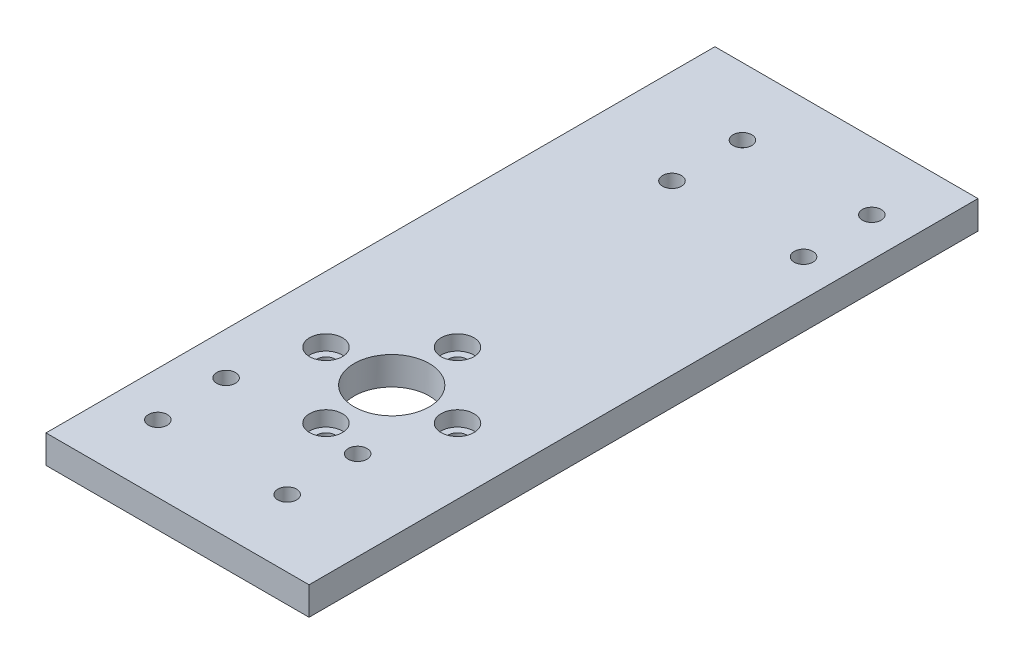
ISO-10303-21;
HEADER;
FILE_DESCRIPTION(('STEP AP214'),'2;1');
FILE_NAME('part.step','',(''),(''),'','','');
FILE_SCHEMA(('AUTOMOTIVE_DESIGN { 1 0 10303 214 1 1 1 1 }'));
ENDSEC;
DATA;
#1=APPLICATION_CONTEXT('core data for automotive mechanical design processes');
#2=APPLICATION_PROTOCOL_DEFINITION('international standard','automotive_design',2000,#1);
#3=PRODUCT_CONTEXT('',#1,'mechanical');
#4=PRODUCT('Part','Part','',(#3));
#5=PRODUCT_RELATED_PRODUCT_CATEGORY('part','',(#4));
#6=PRODUCT_DEFINITION_FORMATION('','',#4);
#7=PRODUCT_DEFINITION_CONTEXT('part definition',#1,'design');
#8=PRODUCT_DEFINITION('design','',#6,#7);
#9=PRODUCT_DEFINITION_SHAPE('','',#8);
#10=(LENGTH_UNIT() NAMED_UNIT(*) SI_UNIT(.MILLI.,.METRE.));
#11=(NAMED_UNIT(*) PLANE_ANGLE_UNIT() SI_UNIT($,.RADIAN.));
#12=(NAMED_UNIT(*) SI_UNIT($,.STERADIAN.) SOLID_ANGLE_UNIT());
#13=UNCERTAINTY_MEASURE_WITH_UNIT(LENGTH_MEASURE(1.E-05),#10,'distance_accuracy_value','');
#14=(GEOMETRIC_REPRESENTATION_CONTEXT(3) GLOBAL_UNCERTAINTY_ASSIGNED_CONTEXT((#13)) GLOBAL_UNIT_ASSIGNED_CONTEXT((#10,
#11,#12)) REPRESENTATION_CONTEXT('',''));
#15=CARTESIAN_POINT('',(0.,0.,0.));
#16=DIRECTION('',(0.,0.,1.));
#17=DIRECTION('',(1.,0.,0.));
#18=AXIS2_PLACEMENT_3D('',#15,#16,#17);
#19=CARTESIAN_POINT('',(-3.91877513505073,-7.,-28.4481628818932));
#20=DIRECTION('',(0.,1.,0.));
#21=DIRECTION('',(0.,0.,1.));
#22=AXIS2_PLACEMENT_3D('',#19,#20,#21);
#23=CYLINDRICAL_SURFACE('',#22,1.00000000000001);
#24=CARTESIAN_POINT('',(-3.91877513505073,3.,-28.4481628818932));
#25=DIRECTION('',(0.,1.,0.));
#26=DIRECTION('',(0.,0.,1.));
#27=AXIS2_PLACEMENT_3D('',#24,#25,#26);
#28=CIRCLE('',#27,1.00000000000001);
#29=CARTESIAN_POINT('',(-3.91877513505073,3.,-27.4481628818932));
#30=VERTEX_POINT('',#29);
#31=EDGE_CURVE('E243',#30,#30,#28,.T.);
#32=ORIENTED_EDGE('',*,*,#31,.T.);
#33=EDGE_LOOP('',(#32));
#34=FACE_BOUND('',#33,.T.);
#35=CARTESIAN_POINT('',(-3.91877513505073,1.6,-28.4481628818932));
#36=DIRECTION('',(0.,-1.,0.));
#37=DIRECTION('',(0.,0.,-1.));
#38=AXIS2_PLACEMENT_3D('',#35,#36,#37);
#39=CIRCLE('',#38,1.00000000000001);
#40=CARTESIAN_POINT('',(-3.91877513505073,1.6,-29.4481628818932));
#41=VERTEX_POINT('',#40);
#42=EDGE_CURVE('E42',#41,#41,#39,.F.);
#43=ORIENTED_EDGE('',*,*,#42,.F.);
#44=EDGE_LOOP('',(#43));
#45=FACE_BOUND('',#44,.T.);
#46=ADVANCED_FACE('F38',(#34,#45),#23,.F.);
#47=CARTESIAN_POINT('',(4.51877513505392,-7.,20.9481628818913));
#48=DIRECTION('',(0.,1.,0.));
#49=DIRECTION('',(0.,0.,1.));
#50=AXIS2_PLACEMENT_3D('',#47,#48,#49);
#51=CYLINDRICAL_SURFACE('',#50,1.00000000000002);
#52=CARTESIAN_POINT('',(4.51877513505392,3.,20.9481628818913));
#53=DIRECTION('',(0.,1.,0.));
#54=DIRECTION('',(0.,0.,1.));
#55=AXIS2_PLACEMENT_3D('',#52,#53,#54);
#56=CIRCLE('',#55,1.00000000000002);
#57=CARTESIAN_POINT('',(4.51877513505392,3.,21.9481628818913));
#58=VERTEX_POINT('',#57);
#59=EDGE_CURVE('E246',#58,#58,#56,.T.);
#60=ORIENTED_EDGE('',*,*,#59,.T.);
#61=EDGE_LOOP('',(#60));
#62=FACE_BOUND('',#61,.T.);
#63=CARTESIAN_POINT('',(4.51877513505392,1.6,20.9481628818913));
#64=DIRECTION('',(0.,-1.,0.));
#65=DIRECTION('',(0.,0.,-1.));
#66=AXIS2_PLACEMENT_3D('',#63,#64,#65);
#67=CIRCLE('',#66,1.00000000000002);
#68=CARTESIAN_POINT('',(4.51877513505392,1.6,19.9481628818913));
#69=VERTEX_POINT('',#68);
#70=EDGE_CURVE('E178',#69,#69,#67,.F.);
#71=ORIENTED_EDGE('',*,*,#70,.F.);
#72=EDGE_LOOP('',(#71));
#73=FACE_BOUND('',#72,.T.);
#74=ADVANCED_FACE('F279',(#62,#73),#51,.F.);
#75=CARTESIAN_POINT('',(4.51877513505393,-7.,28.4481628818913));
#76=DIRECTION('',(0.,1.,0.));
#77=DIRECTION('',(0.,0.,1.));
#78=AXIS2_PLACEMENT_3D('',#75,#76,#77);
#79=CYLINDRICAL_SURFACE('',#78,1.00000000000002);
#80=CARTESIAN_POINT('',(4.51877513505393,3.,28.4481628818913));
#81=DIRECTION('',(0.,1.,0.));
#82=DIRECTION('',(0.,0.,1.));
#83=AXIS2_PLACEMENT_3D('',#80,#81,#82);
#84=CIRCLE('',#83,1.00000000000002);
#85=CARTESIAN_POINT('',(4.51877513505393,3.,29.4481628818913));
#86=VERTEX_POINT('',#85);
#87=EDGE_CURVE('E249',#86,#86,#84,.T.);
#88=ORIENTED_EDGE('',*,*,#87,.T.);
#89=EDGE_LOOP('',(#88));
#90=FACE_BOUND('',#89,.T.);
#91=CARTESIAN_POINT('',(4.51877513505393,1.6,28.4481628818913));
#92=DIRECTION('',(0.,-1.,0.));
#93=DIRECTION('',(0.,0.,-1.));
#94=AXIS2_PLACEMENT_3D('',#91,#92,#93);
#95=CIRCLE('',#94,1.00000000000002);
#96=CARTESIAN_POINT('',(4.51877513505393,1.6,27.4481628818913));
#97=VERTEX_POINT('',#96);
#98=EDGE_CURVE('E174',#97,#97,#95,.F.);
#99=ORIENTED_EDGE('',*,*,#98,.F.);
#100=EDGE_LOOP('',(#99));
#101=FACE_BOUND('',#100,.T.);
#102=ADVANCED_FACE('F285',(#90,#101),#79,.F.);
#103=CARTESIAN_POINT('',(-9.48122486494609,-7.,20.9481628818913));
#104=DIRECTION('',(0.,1.,0.));
#105=DIRECTION('',(0.,0.,1.));
#106=AXIS2_PLACEMENT_3D('',#103,#104,#105);
#107=CYLINDRICAL_SURFACE('',#106,1.00000000000001);
#108=CARTESIAN_POINT('',(-9.48122486494609,3.,20.9481628818913));
#109=DIRECTION('',(0.,1.,0.));
#110=DIRECTION('',(0.,0.,1.));
#111=AXIS2_PLACEMENT_3D('',#108,#109,#110);
#112=CIRCLE('',#111,1.00000000000001);
#113=CARTESIAN_POINT('',(-9.48122486494609,3.,21.9481628818913));
#114=VERTEX_POINT('',#113);
#115=EDGE_CURVE('E255',#114,#114,#112,.T.);
#116=ORIENTED_EDGE('',*,*,#115,.T.);
#117=EDGE_LOOP('',(#116));
#118=FACE_BOUND('',#117,.T.);
#119=CARTESIAN_POINT('',(-9.48122486494609,1.6,20.9481628818913));
#120=DIRECTION('',(0.,-1.,0.));
#121=DIRECTION('',(0.,0.,-1.));
#122=AXIS2_PLACEMENT_3D('',#119,#120,#121);
#123=CIRCLE('',#122,1.00000000000001);
#124=CARTESIAN_POINT('',(-9.48122486494609,1.6,19.9481628818913));
#125=VERTEX_POINT('',#124);
#126=EDGE_CURVE('E169',#125,#125,#123,.F.);
#127=ORIENTED_EDGE('',*,*,#126,.F.);
#128=EDGE_LOOP('',(#127));
#129=FACE_BOUND('',#128,.T.);
#130=ADVANCED_FACE('F295',(#118,#129),#107,.F.);
#131=CARTESIAN_POINT('',(-9.24883244467996,-7.,28.4481628818913));
#132=DIRECTION('',(0.,1.,0.));
#133=DIRECTION('',(0.,0.,1.));
#134=AXIS2_PLACEMENT_3D('',#131,#132,#133);
#135=CYLINDRICAL_SURFACE('',#134,1.00000000000001);
#136=CARTESIAN_POINT('',(-9.24883244467996,3.,28.4481628818913));
#137=DIRECTION('',(0.,1.,0.));
#138=DIRECTION('',(0.,0.,1.));
#139=AXIS2_PLACEMENT_3D('',#136,#137,#138);
#140=CIRCLE('',#139,1.00000000000001);
#141=CARTESIAN_POINT('',(-9.24883244467996,3.,29.4481628818913));
#142=VERTEX_POINT('',#141);
#143=EDGE_CURVE('E252',#142,#142,#140,.T.);
#144=ORIENTED_EDGE('',*,*,#143,.T.);
#145=EDGE_LOOP('',(#144));
#146=FACE_BOUND('',#145,.T.);
#147=CARTESIAN_POINT('',(-9.24883244467996,1.6,28.4481628818913));
#148=DIRECTION('',(0.,-1.,0.));
#149=DIRECTION('',(0.,0.,-1.));
#150=AXIS2_PLACEMENT_3D('',#147,#148,#149);
#151=CIRCLE('',#150,1.00000000000001);
#152=CARTESIAN_POINT('',(-9.24883244467996,1.6,27.4481628818913));
#153=VERTEX_POINT('',#152);
#154=EDGE_CURVE('E164',#153,#153,#151,.F.);
#155=ORIENTED_EDGE('',*,*,#154,.F.);
#156=EDGE_LOOP('',(#155));
#157=FACE_BOUND('',#156,.T.);
#158=ADVANCED_FACE('F297',(#146,#157),#135,.F.);
#159=CARTESIAN_POINT('',(10.0812248649493,-7.,-20.9481628818932));
#160=DIRECTION('',(0.,1.,0.));
#161=DIRECTION('',(0.,0.,1.));
#162=AXIS2_PLACEMENT_3D('',#159,#160,#161);
#163=CYLINDRICAL_SURFACE('',#162,1.);
#164=CARTESIAN_POINT('',(10.0812248649493,3.,-20.9481628818932));
#165=DIRECTION('',(0.,1.,0.));
#166=DIRECTION('',(0.,0.,1.));
#167=AXIS2_PLACEMENT_3D('',#164,#165,#166);
#168=CIRCLE('',#167,1.);
#169=CARTESIAN_POINT('',(10.0812248649493,3.,-19.9481628818932));
#170=VERTEX_POINT('',#169);
#171=EDGE_CURVE('E237',#170,#170,#168,.T.);
#172=ORIENTED_EDGE('',*,*,#171,.T.);
#173=EDGE_LOOP('',(#172));
#174=FACE_BOUND('',#173,.T.);
#175=CARTESIAN_POINT('',(10.0812248649493,1.6,-20.9481628818932));
#176=DIRECTION('',(0.,-1.,0.));
#177=DIRECTION('',(0.,0.,-1.));
#178=AXIS2_PLACEMENT_3D('',#175,#176,#177);
#179=CIRCLE('',#178,1.);
#180=CARTESIAN_POINT('',(10.0812248649493,1.6,-21.9481628818932));
#181=VERTEX_POINT('',#180);
#182=EDGE_CURVE('E159',#181,#181,#179,.F.);
#183=ORIENTED_EDGE('',*,*,#182,.F.);
#184=EDGE_LOOP('',(#183));
#185=FACE_BOUND('',#184,.T.);
#186=ADVANCED_FACE('F300',(#174,#185),#163,.F.);
#187=CARTESIAN_POINT('',(9.84883244468316,-7.,-28.4481628818932));
#188=DIRECTION('',(0.,1.,0.));
#189=DIRECTION('',(0.,0.,1.));
#190=AXIS2_PLACEMENT_3D('',#187,#188,#189);
#191=CYLINDRICAL_SURFACE('',#190,1.00000000000001);
#192=CARTESIAN_POINT('',(9.84883244468316,3.,-28.4481628818932));
#193=DIRECTION('',(0.,1.,0.));
#194=DIRECTION('',(0.,0.,1.));
#195=AXIS2_PLACEMENT_3D('',#192,#193,#194);
#196=CIRCLE('',#195,1.00000000000001);
#197=CARTESIAN_POINT('',(9.84883244468316,3.,-27.4481628818932));
#198=VERTEX_POINT('',#197);
#199=EDGE_CURVE('E240',#198,#198,#196,.T.);
#200=ORIENTED_EDGE('',*,*,#199,.T.);
#201=EDGE_LOOP('',(#200));
#202=FACE_BOUND('',#201,.T.);
#203=CARTESIAN_POINT('',(9.84883244468316,1.6,-28.4481628818932));
#204=DIRECTION('',(0.,-1.,0.));
#205=DIRECTION('',(0.,0.,-1.));
#206=AXIS2_PLACEMENT_3D('',#203,#204,#205);
#207=CIRCLE('',#206,1.00000000000001);
#208=CARTESIAN_POINT('',(9.84883244468316,1.6,-29.4481628818932));
#209=VERTEX_POINT('',#208);
#210=EDGE_CURVE('E154',#209,#209,#207,.F.);
#211=ORIENTED_EDGE('',*,*,#210,.F.);
#212=EDGE_LOOP('',(#211));
#213=FACE_BOUND('',#212,.T.);
#214=ADVANCED_FACE('F290',(#202,#213),#191,.F.);
#215=CARTESIAN_POINT('',(-3.91877513505072,-7.,-20.9481628818932));
#216=DIRECTION('',(0.,1.,0.));
#217=DIRECTION('',(0.,0.,1.));
#218=AXIS2_PLACEMENT_3D('',#215,#216,#217);
#219=CYLINDRICAL_SURFACE('',#218,1.00000000000001);
#220=CARTESIAN_POINT('',(-3.91877513505072,3.,-20.9481628818932));
#221=DIRECTION('',(0.,1.,0.));
#222=DIRECTION('',(0.,0.,1.));
#223=AXIS2_PLACEMENT_3D('',#220,#221,#222);
#224=CIRCLE('',#223,1.00000000000001);
#225=CARTESIAN_POINT('',(-3.91877513505072,3.,-19.9481628818932));
#226=VERTEX_POINT('',#225);
#227=EDGE_CURVE('E132',#226,#226,#224,.T.);
#228=ORIENTED_EDGE('',*,*,#227,.T.);
#229=EDGE_LOOP('',(#228));
#230=FACE_BOUND('',#229,.T.);
#231=CARTESIAN_POINT('',(-3.91877513505072,1.6,-20.9481628818932));
#232=DIRECTION('',(0.,-1.,0.));
#233=DIRECTION('',(0.,0.,-1.));
#234=AXIS2_PLACEMENT_3D('',#231,#232,#233);
#235=CIRCLE('',#234,1.00000000000001);
#236=CARTESIAN_POINT('',(-3.91877513505072,1.6,-21.9481628818932));
#237=VERTEX_POINT('',#236);
#238=EDGE_CURVE('E149',#237,#237,#235,.F.);
#239=ORIENTED_EDGE('',*,*,#238,.F.);
#240=EDGE_LOOP('',(#239));
#241=FACE_BOUND('',#240,.T.);
#242=ADVANCED_FACE('F320',(#230,#241),#219,.F.);
#243=CARTESIAN_POINT('',(7.0000000000001,-7.,12.7999999999978));
#244=DIRECTION('',(0.,1.,0.));
#245=DIRECTION('',(0.,0.,1.));
#246=AXIS2_PLACEMENT_3D('',#243,#244,#245);
#247=CYLINDRICAL_SURFACE('',#246,1.);
#248=CARTESIAN_POINT('',(7.0000000000001,0.,12.7999999999978));
#249=DIRECTION('',(0.,-1.,0.));
#250=DIRECTION('',(0.,0.,-1.));
#251=AXIS2_PLACEMENT_3D('',#248,#249,#250);
#252=CIRCLE('',#251,1.);
#253=CARTESIAN_POINT('',(7.0000000000001,0.,11.7999999999978));
#254=VERTEX_POINT('',#253);
#255=EDGE_CURVE('E116',#254,#254,#252,.T.);
#256=ORIENTED_EDGE('',*,*,#255,.T.);
#257=EDGE_LOOP('',(#256));
#258=FACE_BOUND('',#257,.T.);
#259=CARTESIAN_POINT('',(7.0000000000001,1.4,12.7999999999978));
#260=DIRECTION('',(0.,1.,0.));
#261=DIRECTION('',(0.,0.,1.));
#262=AXIS2_PLACEMENT_3D('',#259,#260,#261);
#263=CIRCLE('',#262,1.);
#264=CARTESIAN_POINT('',(7.0000000000001,1.4,13.7999999999978));
#265=VERTEX_POINT('',#264);
#266=EDGE_CURVE('E144',#265,#265,#263,.F.);
#267=ORIENTED_EDGE('',*,*,#266,.F.);
#268=EDGE_LOOP('',(#267));
#269=FACE_BOUND('',#268,.T.);
#270=ADVANCED_FACE('F313',(#258,#269),#247,.F.);
#271=CARTESIAN_POINT('',(-6.9999999999999,-7.,12.7999999999979));
#272=DIRECTION('',(0.,1.,0.));
#273=DIRECTION('',(0.,0.,1.));
#274=AXIS2_PLACEMENT_3D('',#271,#272,#273);
#275=CYLINDRICAL_SURFACE('',#274,1.);
#276=CARTESIAN_POINT('',(-6.9999999999999,0.,12.7999999999979));
#277=DIRECTION('',(0.,-1.,0.));
#278=DIRECTION('',(0.,0.,-1.));
#279=AXIS2_PLACEMENT_3D('',#276,#277,#278);
#280=CIRCLE('',#279,1.);
#281=CARTESIAN_POINT('',(-6.9999999999999,0.,11.7999999999979));
#282=VERTEX_POINT('',#281);
#283=EDGE_CURVE('E122',#282,#282,#280,.T.);
#284=ORIENTED_EDGE('',*,*,#283,.T.);
#285=EDGE_LOOP('',(#284));
#286=FACE_BOUND('',#285,.T.);
#287=CARTESIAN_POINT('',(-6.9999999999999,1.4,12.7999999999979));
#288=DIRECTION('',(0.,1.,0.));
#289=DIRECTION('',(0.,0.,1.));
#290=AXIS2_PLACEMENT_3D('',#287,#288,#289);
#291=CIRCLE('',#290,1.);
#292=CARTESIAN_POINT('',(-6.9999999999999,1.4,13.7999999999979));
#293=VERTEX_POINT('',#292);
#294=EDGE_CURVE('E139',#293,#293,#291,.F.);
#295=ORIENTED_EDGE('',*,*,#294,.F.);
#296=EDGE_LOOP('',(#295));
#297=FACE_BOUND('',#296,.T.);
#298=ADVANCED_FACE('F309',(#286,#297),#275,.F.);
#299=CARTESIAN_POINT('',(0.,-7.,5.79999999999792));
#300=DIRECTION('',(0.,1.,0.));
#301=DIRECTION('',(0.,0.,1.));
#302=AXIS2_PLACEMENT_3D('',#299,#300,#301);
#303=CYLINDRICAL_SURFACE('',#302,1.);
#304=CARTESIAN_POINT('',(0.,0.,5.79999999999792));
#305=DIRECTION('',(0.,-1.,0.));
#306=DIRECTION('',(0.,0.,-1.));
#307=AXIS2_PLACEMENT_3D('',#304,#305,#306);
#308=CIRCLE('',#307,1.);
#309=CARTESIAN_POINT('',(0.,0.,4.79999999999792));
#310=VERTEX_POINT('',#309);
#311=EDGE_CURVE('E108',#310,#310,#308,.T.);
#312=ORIENTED_EDGE('',*,*,#311,.T.);
#313=EDGE_LOOP('',(#312));
#314=FACE_BOUND('',#313,.T.);
#315=CARTESIAN_POINT('',(0.,1.4,5.79999999999792));
#316=DIRECTION('',(0.,1.,0.));
#317=DIRECTION('',(0.,0.,1.));
#318=AXIS2_PLACEMENT_3D('',#315,#316,#317);
#319=CIRCLE('',#318,1.);
#320=CARTESIAN_POINT('',(0.,1.4,6.79999999999792));
#321=VERTEX_POINT('',#320);
#322=EDGE_CURVE('E134',#321,#321,#319,.F.);
#323=ORIENTED_EDGE('',*,*,#322,.F.);
#324=EDGE_LOOP('',(#323));
#325=FACE_BOUND('',#324,.T.);
#326=ADVANCED_FACE('F312',(#314,#325),#303,.F.);
#327=CARTESIAN_POINT('',(1.45764745514838E-13,-7.,19.7999999999979));
#328=DIRECTION('',(0.,1.,0.));
#329=DIRECTION('',(0.,0.,1.));
#330=AXIS2_PLACEMENT_3D('',#327,#328,#329);
#331=CYLINDRICAL_SURFACE('',#330,1.);
#332=CARTESIAN_POINT('',(1.45764745514838E-13,0.,19.7999999999979));
#333=DIRECTION('',(0.,-1.,0.));
#334=DIRECTION('',(0.,0.,-1.));
#335=AXIS2_PLACEMENT_3D('',#332,#333,#334);
#336=CIRCLE('',#335,1.);
#337=CARTESIAN_POINT('',(1.45764745514838E-13,0.,18.7999999999979));
#338=VERTEX_POINT('',#337);
#339=EDGE_CURVE('E119',#338,#338,#336,.T.);
#340=ORIENTED_EDGE('',*,*,#339,.T.);
#341=EDGE_LOOP('',(#340));
#342=FACE_BOUND('',#341,.T.);
#343=CARTESIAN_POINT('',(1.45764745514838E-13,1.4,19.7999999999979));
#344=DIRECTION('',(0.,1.,0.));
#345=DIRECTION('',(0.,0.,1.));
#346=AXIS2_PLACEMENT_3D('',#343,#344,#345);
#347=CIRCLE('',#346,1.);
#348=CARTESIAN_POINT('',(1.45764745514838E-13,1.4,20.7999999999979));
#349=VERTEX_POINT('',#348);
#350=EDGE_CURVE('E129',#349,#349,#347,.F.);
#351=ORIENTED_EDGE('',*,*,#350,.F.);
#352=EDGE_LOOP('',(#351));
#353=FACE_BOUND('',#352,.T.);
#354=ADVANCED_FACE('F315',(#342,#353),#331,.F.);
#355=CARTESIAN_POINT('',(14.,3.,35.6));
#356=DIRECTION('',(-1.,0.,0.));
#357=DIRECTION('',(0.,0.,1.));
#358=AXIS2_PLACEMENT_3D('',#355,#356,#357);
#359=PLANE('',#358);
#360=DIRECTION('',(0.,0.,-1.));
#361=VECTOR('',#360,1.);
#362=CARTESIAN_POINT('',(14.,0.,35.6));
#363=LINE('',#362,#361);
#364=CARTESIAN_POINT('',(14.,0.,35.6));
#365=VERTEX_POINT('',#364);
#366=CARTESIAN_POINT('',(14.,0.,-35.6));
#367=VERTEX_POINT('',#366);
#368=EDGE_CURVE('E105',#365,#367,#363,.T.);
#369=ORIENTED_EDGE('',*,*,#368,.T.);
#370=DIRECTION('',(0.,-1.,0.));
#371=VECTOR('',#370,1.);
#372=CARTESIAN_POINT('',(14.,3.,-35.6));
#373=LINE('',#372,#371);
#374=CARTESIAN_POINT('',(14.,3.,-35.6));
#375=VERTEX_POINT('',#374);
#376=EDGE_CURVE('E11',#375,#367,#373,.T.);
#377=ORIENTED_EDGE('',*,*,#376,.F.);
#378=DIRECTION('',(0.,0.,-1.));
#379=VECTOR('',#378,1.);
#380=CARTESIAN_POINT('',(14.,3.,35.6));
#381=LINE('',#380,#379);
#382=CARTESIAN_POINT('',(14.,3.,35.6));
#383=VERTEX_POINT('',#382);
#384=EDGE_CURVE('E92',#383,#375,#381,.T.);
#385=ORIENTED_EDGE('',*,*,#384,.F.);
#386=DIRECTION('',(0.,-1.,0.));
#387=VECTOR('',#386,1.);
#388=CARTESIAN_POINT('',(14.,3.,35.6));
#389=LINE('',#388,#387);
#390=EDGE_CURVE('E101',#383,#365,#389,.T.);
#391=ORIENTED_EDGE('',*,*,#390,.T.);
#392=EDGE_LOOP('',(#369,#377,#385,#391));
#393=FACE_BOUND('',#392,.T.);
#394=ADVANCED_FACE('F40',(#393),#359,.F.);
#395=CARTESIAN_POINT('',(-14.,3.,-35.6));
#396=DIRECTION('',(0.,0.,1.));
#397=DIRECTION('',(1.,0.,0.));
#398=AXIS2_PLACEMENT_3D('',#395,#396,#397);
#399=PLANE('',#398);
#400=DIRECTION('',(-1.,0.,0.));
#401=VECTOR('',#400,1.);
#402=CARTESIAN_POINT('',(-14.,0.,-35.6));
#403=LINE('',#402,#401);
#404=CARTESIAN_POINT('',(-14.,0.,-35.6));
#405=VERTEX_POINT('',#404);
#406=EDGE_CURVE('E96',#367,#405,#403,.T.);
#407=ORIENTED_EDGE('',*,*,#406,.T.);
#408=DIRECTION('',(0.,-1.,0.));
#409=VECTOR('',#408,1.);
#410=CARTESIAN_POINT('',(-14.,3.,-35.6));
#411=LINE('',#410,#409);
#412=CARTESIAN_POINT('',(-14.,3.,-35.6));
#413=VERTEX_POINT('',#412);
#414=EDGE_CURVE('E48',#413,#405,#411,.T.);
#415=ORIENTED_EDGE('',*,*,#414,.F.);
#416=DIRECTION('',(-1.,0.,0.));
#417=VECTOR('',#416,1.);
#418=CARTESIAN_POINT('',(-14.,3.,-35.6));
#419=LINE('',#418,#417);
#420=EDGE_CURVE('E87',#375,#413,#419,.T.);
#421=ORIENTED_EDGE('',*,*,#420,.F.);
#422=ORIENTED_EDGE('',*,*,#376,.T.);
#423=EDGE_LOOP('',(#407,#415,#421,#422));
#424=FACE_BOUND('',#423,.T.);
#425=ADVANCED_FACE('F95',(#424),#399,.F.);
#426=CARTESIAN_POINT('',(-14.,3.,35.6));
#427=DIRECTION('',(1.,0.,0.));
#428=DIRECTION('',(0.,0.,-1.));
#429=AXIS2_PLACEMENT_3D('',#426,#427,#428);
#430=PLANE('',#429);
#431=DIRECTION('',(0.,0.,1.));
#432=VECTOR('',#431,1.);
#433=CARTESIAN_POINT('',(-14.,0.,35.6));
#434=LINE('',#433,#432);
#435=CARTESIAN_POINT('',(-14.,0.,35.6));
#436=VERTEX_POINT('',#435);
#437=EDGE_CURVE('E74',#405,#436,#434,.T.);
#438=ORIENTED_EDGE('',*,*,#437,.T.);
#439=DIRECTION('',(0.,-1.,0.));
#440=VECTOR('',#439,1.);
#441=CARTESIAN_POINT('',(-14.,3.,35.6));
#442=LINE('',#441,#440);
#443=CARTESIAN_POINT('',(-14.,3.,35.6));
#444=VERTEX_POINT('',#443);
#445=EDGE_CURVE('E97',#444,#436,#442,.T.);
#446=ORIENTED_EDGE('',*,*,#445,.F.);
#447=DIRECTION('',(0.,0.,1.));
#448=VECTOR('',#447,1.);
#449=CARTESIAN_POINT('',(-14.,3.,35.6));
#450=LINE('',#449,#448);
#451=EDGE_CURVE('E90',#413,#444,#450,.T.);
#452=ORIENTED_EDGE('',*,*,#451,.F.);
#453=ORIENTED_EDGE('',*,*,#414,.T.);
#454=EDGE_LOOP('',(#438,#446,#452,#453));
#455=FACE_BOUND('',#454,.T.);
#456=ADVANCED_FACE('F99',(#455),#430,.F.);
#457=CARTESIAN_POINT('',(-14.,3.,35.6));
#458=DIRECTION('',(0.,0.,-1.));
#459=DIRECTION('',(-1.,0.,0.));
#460=AXIS2_PLACEMENT_3D('',#457,#458,#459);
#461=PLANE('',#460);
#462=DIRECTION('',(1.,0.,0.));
#463=VECTOR('',#462,1.);
#464=CARTESIAN_POINT('',(-14.,0.,35.6));
#465=LINE('',#464,#463);
#466=EDGE_CURVE('E80',#436,#365,#465,.T.);
#467=ORIENTED_EDGE('',*,*,#466,.T.);
#468=ORIENTED_EDGE('',*,*,#390,.F.);
#469=DIRECTION('',(1.,0.,0.));
#470=VECTOR('',#469,1.);
#471=CARTESIAN_POINT('',(-14.,3.,35.6));
#472=LINE('',#471,#470);
#473=EDGE_CURVE('E57',#444,#383,#472,.T.);
#474=ORIENTED_EDGE('',*,*,#473,.F.);
#475=ORIENTED_EDGE('',*,*,#445,.T.);
#476=EDGE_LOOP('',(#467,#468,#474,#475));
#477=FACE_BOUND('',#476,.T.);
#478=ADVANCED_FACE('F265',(#477),#461,.F.);
#479=CARTESIAN_POINT('',(0.,3.,0.));
#480=DIRECTION('',(0.,-1.,0.));
#481=DIRECTION('',(0.,0.,-1.));
#482=AXIS2_PLACEMENT_3D('',#479,#480,#481);
#483=PLANE('',#482);
#484=CARTESIAN_POINT('',(7.0000000000001,3.,12.7999999999978));
#485=DIRECTION('',(0.,1.,0.));
#486=DIRECTION('',(0.,0.,1.));
#487=AXIS2_PLACEMENT_3D('',#484,#485,#486);
#488=CIRCLE('',#487,1.75);
#489=CARTESIAN_POINT('',(7.0000000000001,3.,14.5499999999978));
#490=VERTEX_POINT('',#489);
#491=EDGE_CURVE('E152',#490,#490,#488,.T.);
#492=ORIENTED_EDGE('',*,*,#491,.F.);
#493=EDGE_LOOP('',(#492));
#494=FACE_BOUND('',#493,.T.);
#495=CARTESIAN_POINT('',(-6.9999999999999,3.,12.7999999999979));
#496=DIRECTION('',(0.,1.,0.));
#497=DIRECTION('',(0.,0.,1.));
#498=AXIS2_PLACEMENT_3D('',#495,#496,#497);
#499=CIRCLE('',#498,1.75);
#500=CARTESIAN_POINT('',(-6.9999999999999,3.,14.5499999999979));
#501=VERTEX_POINT('',#500);
#502=EDGE_CURVE('E147',#501,#501,#499,.T.);
#503=ORIENTED_EDGE('',*,*,#502,.F.);
#504=EDGE_LOOP('',(#503));
#505=FACE_BOUND('',#504,.T.);
#506=CARTESIAN_POINT('',(0.,3.,5.79999999999792));
#507=DIRECTION('',(0.,1.,0.));
#508=DIRECTION('',(0.,0.,1.));
#509=AXIS2_PLACEMENT_3D('',#506,#507,#508);
#510=CIRCLE('',#509,1.75);
#511=CARTESIAN_POINT('',(0.,3.,7.54999999999792));
#512=VERTEX_POINT('',#511);
#513=EDGE_CURVE('E142',#512,#512,#510,.T.);
#514=ORIENTED_EDGE('',*,*,#513,.F.);
#515=EDGE_LOOP('',(#514));
#516=FACE_BOUND('',#515,.T.);
#517=CARTESIAN_POINT('',(1.45764745514838E-13,3.,19.7999999999979));
#518=DIRECTION('',(0.,1.,0.));
#519=DIRECTION('',(0.,0.,1.));
#520=AXIS2_PLACEMENT_3D('',#517,#518,#519);
#521=CIRCLE('',#520,1.75);
#522=CARTESIAN_POINT('',(1.45764745514838E-13,3.,21.5499999999979));
#523=VERTEX_POINT('',#522);
#524=EDGE_CURVE('E137',#523,#523,#521,.T.);
#525=ORIENTED_EDGE('',*,*,#524,.F.);
#526=EDGE_LOOP('',(#525));
#527=FACE_BOUND('',#526,.T.);
#528=ORIENTED_EDGE('',*,*,#227,.F.);
#529=EDGE_LOOP('',(#528));
#530=FACE_BOUND('',#529,.T.);
#531=ORIENTED_EDGE('',*,*,#171,.F.);
#532=EDGE_LOOP('',(#531));
#533=FACE_BOUND('',#532,.T.);
#534=ORIENTED_EDGE('',*,*,#199,.F.);
#535=EDGE_LOOP('',(#534));
#536=FACE_BOUND('',#535,.T.);
#537=ORIENTED_EDGE('',*,*,#31,.F.);
#538=EDGE_LOOP('',(#537));
#539=FACE_BOUND('',#538,.T.);
#540=ORIENTED_EDGE('',*,*,#59,.F.);
#541=EDGE_LOOP('',(#540));
#542=FACE_BOUND('',#541,.T.);
#543=ORIENTED_EDGE('',*,*,#87,.F.);
#544=EDGE_LOOP('',(#543));
#545=FACE_BOUND('',#544,.T.);
#546=ORIENTED_EDGE('',*,*,#143,.F.);
#547=EDGE_LOOP('',(#546));
#548=FACE_BOUND('',#547,.T.);
#549=ORIENTED_EDGE('',*,*,#115,.F.);
#550=EDGE_LOOP('',(#549));
#551=FACE_BOUND('',#550,.T.);
#552=CARTESIAN_POINT('',(0.,3.,12.7999999999985));
#553=DIRECTION('',(0.,1.,0.));
#554=DIRECTION('',(0.,0.,1.));
#555=AXIS2_PLACEMENT_3D('',#552,#553,#554);
#556=CIRCLE('',#555,4.);
#557=CARTESIAN_POINT('',(0.,3.,16.7999999999985));
#558=VERTEX_POINT('',#557);
#559=EDGE_CURVE('E128',#558,#558,#556,.T.);
#560=ORIENTED_EDGE('',*,*,#559,.F.);
#561=EDGE_LOOP('',(#560));
#562=FACE_BOUND('',#561,.T.);
#563=ORIENTED_EDGE('',*,*,#384,.T.);
#564=ORIENTED_EDGE('',*,*,#420,.T.);
#565=ORIENTED_EDGE('',*,*,#451,.T.);
#566=ORIENTED_EDGE('',*,*,#473,.T.);
#567=EDGE_LOOP('',(#563,#564,#565,#566));
#568=FACE_BOUND('',#567,.T.);
#569=ADVANCED_FACE('F88',(#494,#505,#516,#527,#530,#533,#536,#539,#542,#545,#548,#551,#562,
#568),#483,.F.);
#570=CARTESIAN_POINT('',(0.,0.,0.));
#571=DIRECTION('',(0.,-1.,0.));
#572=DIRECTION('',(0.,0.,-1.));
#573=AXIS2_PLACEMENT_3D('',#570,#571,#572);
#574=PLANE('',#573);
#575=CARTESIAN_POINT('',(-3.91877513505052,0.,-28.4481628818932));
#576=DIRECTION('',(0.,-1.,0.));
#577=DIRECTION('',(0.,0.,-1.));
#578=AXIS2_PLACEMENT_3D('',#575,#576,#577);
#579=CIRCLE('',#578,1.75);
#580=CARTESIAN_POINT('',(-3.91877513505052,0.,-30.1981628818932));
#581=VERTEX_POINT('',#580);
#582=EDGE_CURVE('E194',#581,#581,#579,.T.);
#583=ORIENTED_EDGE('',*,*,#582,.F.);
#584=EDGE_LOOP('',(#583));
#585=FACE_BOUND('',#584,.T.);
#586=CARTESIAN_POINT('',(4.51877513505412,0.,20.9481628818913));
#587=DIRECTION('',(0.,-1.,0.));
#588=DIRECTION('',(0.,0.,-1.));
#589=AXIS2_PLACEMENT_3D('',#586,#587,#588);
#590=CIRCLE('',#589,1.74999999999999);
#591=CARTESIAN_POINT('',(4.51877513505412,0.,19.1981628818913));
#592=VERTEX_POINT('',#591);
#593=EDGE_CURVE('E187',#592,#592,#590,.T.);
#594=ORIENTED_EDGE('',*,*,#593,.F.);
#595=EDGE_LOOP('',(#594));
#596=FACE_BOUND('',#595,.T.);
#597=CARTESIAN_POINT('',(4.51877513505413,0.,28.4481628818913));
#598=DIRECTION('',(0.,-1.,0.));
#599=DIRECTION('',(0.,0.,-1.));
#600=AXIS2_PLACEMENT_3D('',#597,#598,#599);
#601=CIRCLE('',#600,1.74999999999999);
#602=CARTESIAN_POINT('',(4.51877513505413,0.,26.6981628818913));
#603=VERTEX_POINT('',#602);
#604=EDGE_CURVE('E180',#603,#603,#601,.T.);
#605=ORIENTED_EDGE('',*,*,#604,.F.);
#606=EDGE_LOOP('',(#605));
#607=FACE_BOUND('',#606,.T.);
#608=CARTESIAN_POINT('',(-9.48122486494588,0.,20.9481628818913));
#609=DIRECTION('',(0.,-1.,0.));
#610=DIRECTION('',(0.,0.,-1.));
#611=AXIS2_PLACEMENT_3D('',#608,#609,#610);
#612=CIRCLE('',#611,1.75000000000001);
#613=CARTESIAN_POINT('',(-9.48122486494588,0.,19.1981628818913));
#614=VERTEX_POINT('',#613);
#615=EDGE_CURVE('E176',#614,#614,#612,.T.);
#616=ORIENTED_EDGE('',*,*,#615,.F.);
#617=EDGE_LOOP('',(#616));
#618=FACE_BOUND('',#617,.T.);
#619=CARTESIAN_POINT('',(-9.24883244467975,0.,28.4481628818914));
#620=DIRECTION('',(0.,-1.,0.));
#621=DIRECTION('',(0.,0.,-1.));
#622=AXIS2_PLACEMENT_3D('',#619,#620,#621);
#623=CIRCLE('',#622,1.75000000000001);
#624=CARTESIAN_POINT('',(-9.24883244467975,0.,26.6981628818913));
#625=VERTEX_POINT('',#624);
#626=EDGE_CURVE('E172',#625,#625,#623,.T.);
#627=ORIENTED_EDGE('',*,*,#626,.F.);
#628=EDGE_LOOP('',(#627));
#629=FACE_BOUND('',#628,.T.);
#630=CARTESIAN_POINT('',(10.0812248649495,0.,-20.9481628818932));
#631=DIRECTION('',(0.,-1.,0.));
#632=DIRECTION('',(0.,0.,-1.));
#633=AXIS2_PLACEMENT_3D('',#630,#631,#632);
#634=CIRCLE('',#633,1.75);
#635=CARTESIAN_POINT('',(10.0812248649495,0.,-22.6981628818932));
#636=VERTEX_POINT('',#635);
#637=EDGE_CURVE('E167',#636,#636,#634,.T.);
#638=ORIENTED_EDGE('',*,*,#637,.F.);
#639=EDGE_LOOP('',(#638));
#640=FACE_BOUND('',#639,.T.);
#641=CARTESIAN_POINT('',(9.84883244468337,0.,-28.4481628818932));
#642=DIRECTION('',(0.,-1.,0.));
#643=DIRECTION('',(0.,0.,-1.));
#644=AXIS2_PLACEMENT_3D('',#641,#642,#643);
#645=CIRCLE('',#644,1.75);
#646=CARTESIAN_POINT('',(9.84883244468337,0.,-30.1981628818932));
#647=VERTEX_POINT('',#646);
#648=EDGE_CURVE('E162',#647,#647,#645,.T.);
#649=ORIENTED_EDGE('',*,*,#648,.F.);
#650=EDGE_LOOP('',(#649));
#651=FACE_BOUND('',#650,.T.);
#652=CARTESIAN_POINT('',(-3.91877513505052,0.,-20.9481628818932));
#653=DIRECTION('',(0.,-1.,0.));
#654=DIRECTION('',(0.,0.,-1.));
#655=AXIS2_PLACEMENT_3D('',#652,#653,#654);
#656=CIRCLE('',#655,1.75000000000001);
#657=CARTESIAN_POINT('',(-3.91877513505052,0.,-22.6981628818932));
#658=VERTEX_POINT('',#657);
#659=EDGE_CURVE('E157',#658,#658,#656,.T.);
#660=ORIENTED_EDGE('',*,*,#659,.F.);
#661=EDGE_LOOP('',(#660));
#662=FACE_BOUND('',#661,.T.);
#663=CARTESIAN_POINT('',(0.,0.,12.7999999999985));
#664=DIRECTION('',(0.,-1.,0.));
#665=DIRECTION('',(0.,0.,-1.));
#666=AXIS2_PLACEMENT_3D('',#663,#664,#665);
#667=CIRCLE('',#666,4.);
#668=CARTESIAN_POINT('',(0.,0.,8.79999999999852));
#669=VERTEX_POINT('',#668);
#670=EDGE_CURVE('E125',#669,#669,#667,.T.);
#671=ORIENTED_EDGE('',*,*,#670,.F.);
#672=EDGE_LOOP('',(#671));
#673=FACE_BOUND('',#672,.T.);
#674=ORIENTED_EDGE('',*,*,#283,.F.);
#675=EDGE_LOOP('',(#674));
#676=FACE_BOUND('',#675,.T.);
#677=ORIENTED_EDGE('',*,*,#339,.F.);
#678=EDGE_LOOP('',(#677));
#679=FACE_BOUND('',#678,.T.);
#680=ORIENTED_EDGE('',*,*,#255,.F.);
#681=EDGE_LOOP('',(#680));
#682=FACE_BOUND('',#681,.T.);
#683=ORIENTED_EDGE('',*,*,#311,.F.);
#684=EDGE_LOOP('',(#683));
#685=FACE_BOUND('',#684,.T.);
#686=ORIENTED_EDGE('',*,*,#368,.F.);
#687=ORIENTED_EDGE('',*,*,#466,.F.);
#688=ORIENTED_EDGE('',*,*,#437,.F.);
#689=ORIENTED_EDGE('',*,*,#406,.F.);
#690=EDGE_LOOP('',(#686,#687,#688,#689));
#691=FACE_BOUND('',#690,.T.);
#692=ADVANCED_FACE('F264',(#585,#596,#607,#618,#629,#640,#651,#662,#673,#676,#679,#682,#685,
#691),#574,.T.);
#693=CARTESIAN_POINT('',(0.,-7.,12.7999999999985));
#694=DIRECTION('',(0.,1.,0.));
#695=DIRECTION('',(0.,0.,1.));
#696=AXIS2_PLACEMENT_3D('',#693,#694,#695);
#697=CYLINDRICAL_SURFACE('',#696,4.);
#698=ORIENTED_EDGE('',*,*,#670,.T.);
#699=EDGE_LOOP('',(#698));
#700=FACE_BOUND('',#699,.T.);
#701=ORIENTED_EDGE('',*,*,#559,.T.);
#702=EDGE_LOOP('',(#701));
#703=FACE_BOUND('',#702,.T.);
#704=ADVANCED_FACE('F261',(#700,#703),#697,.F.);
#705=CARTESIAN_POINT('',(1.45764745514838E-13,1.4,19.7999999999979));
#706=DIRECTION('',(0.,1.,0.));
#707=DIRECTION('',(0.,0.,1.));
#708=AXIS2_PLACEMENT_3D('',#705,#706,#707);
#709=PLANE('',#708);
#710=CARTESIAN_POINT('',(1.45764745514838E-13,1.4,19.7999999999979));
#711=DIRECTION('',(0.,1.,0.));
#712=DIRECTION('',(0.,0.,1.));
#713=AXIS2_PLACEMENT_3D('',#710,#711,#712);
#714=CIRCLE('',#713,1.75);
#715=CARTESIAN_POINT('',(1.45764745514838E-13,1.4,21.5499999999979));
#716=VERTEX_POINT('',#715);
#717=EDGE_CURVE('E133',#716,#716,#714,.T.);
#718=ORIENTED_EDGE('',*,*,#717,.T.);
#719=EDGE_LOOP('',(#718));
#720=FACE_BOUND('',#719,.T.);
#721=ORIENTED_EDGE('',*,*,#350,.T.);
#722=EDGE_LOOP('',(#721));
#723=FACE_BOUND('',#722,.T.);
#724=ADVANCED_FACE('F307',(#720,#723),#709,.T.);
#725=CARTESIAN_POINT('',(1.45764745514838E-13,1.4,19.7999999999979));
#726=DIRECTION('',(0.,1.,0.));
#727=DIRECTION('',(0.,0.,1.));
#728=AXIS2_PLACEMENT_3D('',#725,#726,#727);
#729=CYLINDRICAL_SURFACE('',#728,1.75);
#730=ORIENTED_EDGE('',*,*,#717,.F.);
#731=EDGE_LOOP('',(#730));
#732=FACE_BOUND('',#731,.T.);
#733=ORIENTED_EDGE('',*,*,#524,.T.);
#734=EDGE_LOOP('',(#733));
#735=FACE_BOUND('',#734,.T.);
#736=ADVANCED_FACE('F333',(#732,#735),#729,.F.);
#737=CARTESIAN_POINT('',(0.,1.4,5.79999999999792));
#738=DIRECTION('',(0.,1.,0.));
#739=DIRECTION('',(0.,0.,1.));
#740=AXIS2_PLACEMENT_3D('',#737,#738,#739);
#741=PLANE('',#740);
#742=CARTESIAN_POINT('',(0.,1.4,5.79999999999792));
#743=DIRECTION('',(0.,1.,0.));
#744=DIRECTION('',(0.,0.,1.));
#745=AXIS2_PLACEMENT_3D('',#742,#743,#744);
#746=CIRCLE('',#745,1.75);
#747=CARTESIAN_POINT('',(0.,1.4,7.54999999999792));
#748=VERTEX_POINT('',#747);
#749=EDGE_CURVE('E138',#748,#748,#746,.T.);
#750=ORIENTED_EDGE('',*,*,#749,.T.);
#751=EDGE_LOOP('',(#750));
#752=FACE_BOUND('',#751,.T.);
#753=ORIENTED_EDGE('',*,*,#322,.T.);
#754=EDGE_LOOP('',(#753));
#755=FACE_BOUND('',#754,.T.);
#756=ADVANCED_FACE('F330',(#752,#755),#741,.T.);
#757=CARTESIAN_POINT('',(0.,1.4,5.79999999999792));
#758=DIRECTION('',(0.,1.,0.));
#759=DIRECTION('',(0.,0.,1.));
#760=AXIS2_PLACEMENT_3D('',#757,#758,#759);
#761=CYLINDRICAL_SURFACE('',#760,1.75);
#762=ORIENTED_EDGE('',*,*,#749,.F.);
#763=EDGE_LOOP('',(#762));
#764=FACE_BOUND('',#763,.T.);
#765=ORIENTED_EDGE('',*,*,#513,.T.);
#766=EDGE_LOOP('',(#765));
#767=FACE_BOUND('',#766,.T.);
#768=ADVANCED_FACE('F332',(#764,#767),#761,.F.);
#769=CARTESIAN_POINT('',(-6.9999999999999,1.4,12.7999999999979));
#770=DIRECTION('',(0.,1.,0.));
#771=DIRECTION('',(0.,0.,1.));
#772=AXIS2_PLACEMENT_3D('',#769,#770,#771);
#773=PLANE('',#772);
#774=CARTESIAN_POINT('',(-6.9999999999999,1.4,12.7999999999979));
#775=DIRECTION('',(0.,1.,0.));
#776=DIRECTION('',(0.,0.,1.));
#777=AXIS2_PLACEMENT_3D('',#774,#775,#776);
#778=CIRCLE('',#777,1.75);
#779=CARTESIAN_POINT('',(-6.9999999999999,1.4,14.5499999999979));
#780=VERTEX_POINT('',#779);
#781=EDGE_CURVE('E143',#780,#780,#778,.T.);
#782=ORIENTED_EDGE('',*,*,#781,.T.);
#783=EDGE_LOOP('',(#782));
#784=FACE_BOUND('',#783,.T.);
#785=ORIENTED_EDGE('',*,*,#294,.T.);
#786=EDGE_LOOP('',(#785));
#787=FACE_BOUND('',#786,.T.);
#788=ADVANCED_FACE('F340',(#784,#787),#773,.T.);
#789=CARTESIAN_POINT('',(-6.9999999999999,1.4,12.7999999999979));
#790=DIRECTION('',(0.,1.,0.));
#791=DIRECTION('',(0.,0.,1.));
#792=AXIS2_PLACEMENT_3D('',#789,#790,#791);
#793=CYLINDRICAL_SURFACE('',#792,1.75);
#794=ORIENTED_EDGE('',*,*,#781,.F.);
#795=EDGE_LOOP('',(#794));
#796=FACE_BOUND('',#795,.T.);
#797=ORIENTED_EDGE('',*,*,#502,.T.);
#798=EDGE_LOOP('',(#797));
#799=FACE_BOUND('',#798,.T.);
#800=ADVANCED_FACE('F346',(#796,#799),#793,.F.);
#801=CARTESIAN_POINT('',(7.0000000000001,1.4,12.7999999999978));
#802=DIRECTION('',(0.,1.,0.));
#803=DIRECTION('',(0.,0.,1.));
#804=AXIS2_PLACEMENT_3D('',#801,#802,#803);
#805=PLANE('',#804);
#806=CARTESIAN_POINT('',(7.0000000000001,1.4,12.7999999999978));
#807=DIRECTION('',(0.,1.,0.));
#808=DIRECTION('',(0.,0.,1.));
#809=AXIS2_PLACEMENT_3D('',#806,#807,#808);
#810=CIRCLE('',#809,1.75);
#811=CARTESIAN_POINT('',(7.0000000000001,1.4,14.5499999999978));
#812=VERTEX_POINT('',#811);
#813=EDGE_CURVE('E148',#812,#812,#810,.T.);
#814=ORIENTED_EDGE('',*,*,#813,.T.);
#815=EDGE_LOOP('',(#814));
#816=FACE_BOUND('',#815,.T.);
#817=ORIENTED_EDGE('',*,*,#266,.T.);
#818=EDGE_LOOP('',(#817));
#819=FACE_BOUND('',#818,.T.);
#820=ADVANCED_FACE('F396',(#816,#819),#805,.T.);
#821=CARTESIAN_POINT('',(7.0000000000001,1.4,12.7999999999978));
#822=DIRECTION('',(0.,1.,0.));
#823=DIRECTION('',(0.,0.,1.));
#824=AXIS2_PLACEMENT_3D('',#821,#822,#823);
#825=CYLINDRICAL_SURFACE('',#824,1.75);
#826=ORIENTED_EDGE('',*,*,#813,.F.);
#827=EDGE_LOOP('',(#826));
#828=FACE_BOUND('',#827,.T.);
#829=ORIENTED_EDGE('',*,*,#491,.T.);
#830=EDGE_LOOP('',(#829));
#831=FACE_BOUND('',#830,.T.);
#832=ADVANCED_FACE('F391',(#828,#831),#825,.F.);
#833=CARTESIAN_POINT('',(-3.91877513505052,1.6,-20.9481628818932));
#834=DIRECTION('',(0.,-1.,0.));
#835=DIRECTION('',(0.,0.,-1.));
#836=AXIS2_PLACEMENT_3D('',#833,#834,#835);
#837=PLANE('',#836);
#838=CARTESIAN_POINT('',(-3.91877513505052,1.6,-20.9481628818932));
#839=DIRECTION('',(0.,-1.,0.));
#840=DIRECTION('',(0.,0.,-1.));
#841=AXIS2_PLACEMENT_3D('',#838,#839,#840);
#842=CIRCLE('',#841,1.75000000000001);
#843=CARTESIAN_POINT('',(-3.91877513505052,1.6,-22.6981628818932));
#844=VERTEX_POINT('',#843);
#845=EDGE_CURVE('E153',#844,#844,#842,.T.);
#846=ORIENTED_EDGE('',*,*,#845,.T.);
#847=EDGE_LOOP('',(#846));
#848=FACE_BOUND('',#847,.T.);
#849=ORIENTED_EDGE('',*,*,#238,.T.);
#850=EDGE_LOOP('',(#849));
#851=FACE_BOUND('',#850,.T.);
#852=ADVANCED_FACE('F388',(#848,#851),#837,.T.);
#853=CARTESIAN_POINT('',(-3.91877513505052,1.6,-20.9481628818932));
#854=DIRECTION('',(0.,-1.,0.));
#855=DIRECTION('',(0.,0.,-1.));
#856=AXIS2_PLACEMENT_3D('',#853,#854,#855);
#857=CYLINDRICAL_SURFACE('',#856,1.75000000000001);
#858=ORIENTED_EDGE('',*,*,#845,.F.);
#859=EDGE_LOOP('',(#858));
#860=FACE_BOUND('',#859,.T.);
#861=ORIENTED_EDGE('',*,*,#659,.T.);
#862=EDGE_LOOP('',(#861));
#863=FACE_BOUND('',#862,.T.);
#864=ADVANCED_FACE('F385',(#860,#863),#857,.F.);
#865=CARTESIAN_POINT('',(9.84883244468337,1.6,-28.4481628818932));
#866=DIRECTION('',(0.,-1.,0.));
#867=DIRECTION('',(0.,0.,-1.));
#868=AXIS2_PLACEMENT_3D('',#865,#866,#867);
#869=PLANE('',#868);
#870=CARTESIAN_POINT('',(9.84883244468337,1.6,-28.4481628818932));
#871=DIRECTION('',(0.,-1.,0.));
#872=DIRECTION('',(0.,0.,-1.));
#873=AXIS2_PLACEMENT_3D('',#870,#871,#872);
#874=CIRCLE('',#873,1.75);
#875=CARTESIAN_POINT('',(9.84883244468337,1.6,-30.1981628818932));
#876=VERTEX_POINT('',#875);
#877=EDGE_CURVE('E158',#876,#876,#874,.T.);
#878=ORIENTED_EDGE('',*,*,#877,.T.);
#879=EDGE_LOOP('',(#878));
#880=FACE_BOUND('',#879,.T.);
#881=ORIENTED_EDGE('',*,*,#210,.T.);
#882=EDGE_LOOP('',(#881));
#883=FACE_BOUND('',#882,.T.);
#884=ADVANCED_FACE('F377',(#880,#883),#869,.T.);
#885=CARTESIAN_POINT('',(9.84883244468337,1.6,-28.4481628818932));
#886=DIRECTION('',(0.,-1.,0.));
#887=DIRECTION('',(0.,0.,-1.));
#888=AXIS2_PLACEMENT_3D('',#885,#886,#887);
#889=CYLINDRICAL_SURFACE('',#888,1.75);
#890=ORIENTED_EDGE('',*,*,#877,.F.);
#891=EDGE_LOOP('',(#890));
#892=FACE_BOUND('',#891,.T.);
#893=ORIENTED_EDGE('',*,*,#648,.T.);
#894=EDGE_LOOP('',(#893));
#895=FACE_BOUND('',#894,.T.);
#896=ADVANCED_FACE('F367',(#892,#895),#889,.F.);
#897=CARTESIAN_POINT('',(10.0812248649495,1.6,-20.9481628818932));
#898=DIRECTION('',(0.,-1.,0.));
#899=DIRECTION('',(0.,0.,-1.));
#900=AXIS2_PLACEMENT_3D('',#897,#898,#899);
#901=PLANE('',#900);
#902=CARTESIAN_POINT('',(10.0812248649495,1.6,-20.9481628818932));
#903=DIRECTION('',(0.,-1.,0.));
#904=DIRECTION('',(0.,0.,-1.));
#905=AXIS2_PLACEMENT_3D('',#902,#903,#904);
#906=CIRCLE('',#905,1.75);
#907=CARTESIAN_POINT('',(10.0812248649495,1.6,-22.6981628818932));
#908=VERTEX_POINT('',#907);
#909=EDGE_CURVE('E163',#908,#908,#906,.T.);
#910=ORIENTED_EDGE('',*,*,#909,.T.);
#911=EDGE_LOOP('',(#910));
#912=FACE_BOUND('',#911,.T.);
#913=ORIENTED_EDGE('',*,*,#182,.T.);
#914=EDGE_LOOP('',(#913));
#915=FACE_BOUND('',#914,.T.);
#916=ADVANCED_FACE('F364',(#912,#915),#901,.T.);
#917=CARTESIAN_POINT('',(10.0812248649495,1.6,-20.9481628818932));
#918=DIRECTION('',(0.,-1.,0.));
#919=DIRECTION('',(0.,0.,-1.));
#920=AXIS2_PLACEMENT_3D('',#917,#918,#919);
#921=CYLINDRICAL_SURFACE('',#920,1.75);
#922=ORIENTED_EDGE('',*,*,#909,.F.);
#923=EDGE_LOOP('',(#922));
#924=FACE_BOUND('',#923,.T.);
#925=ORIENTED_EDGE('',*,*,#637,.T.);
#926=EDGE_LOOP('',(#925));
#927=FACE_BOUND('',#926,.T.);
#928=ADVANCED_FACE('F366',(#924,#927),#921,.F.);
#929=CARTESIAN_POINT('',(-9.24883244467975,1.6,28.4481628818914));
#930=DIRECTION('',(0.,-1.,0.));
#931=DIRECTION('',(0.,0.,-1.));
#932=AXIS2_PLACEMENT_3D('',#929,#930,#931);
#933=PLANE('',#932);
#934=CARTESIAN_POINT('',(-9.24883244467975,1.6,28.4481628818914));
#935=DIRECTION('',(0.,-1.,0.));
#936=DIRECTION('',(0.,0.,-1.));
#937=AXIS2_PLACEMENT_3D('',#934,#935,#936);
#938=CIRCLE('',#937,1.75000000000001);
#939=CARTESIAN_POINT('',(-9.24883244467975,1.6,26.6981628818913));
#940=VERTEX_POINT('',#939);
#941=EDGE_CURVE('E168',#940,#940,#938,.T.);
#942=ORIENTED_EDGE('',*,*,#941,.T.);
#943=EDGE_LOOP('',(#942));
#944=FACE_BOUND('',#943,.T.);
#945=ORIENTED_EDGE('',*,*,#154,.T.);
#946=EDGE_LOOP('',(#945));
#947=FACE_BOUND('',#946,.T.);
#948=ADVANCED_FACE('F374',(#944,#947),#933,.T.);
#949=CARTESIAN_POINT('',(-9.24883244467975,1.6,28.4481628818914));
#950=DIRECTION('',(0.,-1.,0.));
#951=DIRECTION('',(0.,0.,-1.));
#952=AXIS2_PLACEMENT_3D('',#949,#950,#951);
#953=CYLINDRICAL_SURFACE('',#952,1.75000000000001);
#954=ORIENTED_EDGE('',*,*,#941,.F.);
#955=EDGE_LOOP('',(#954));
#956=FACE_BOUND('',#955,.T.);
#957=ORIENTED_EDGE('',*,*,#626,.T.);
#958=EDGE_LOOP('',(#957));
#959=FACE_BOUND('',#958,.T.);
#960=ADVANCED_FACE('F381',(#956,#959),#953,.F.);
#961=CARTESIAN_POINT('',(-9.48122486494588,1.6,20.9481628818913));
#962=DIRECTION('',(0.,-1.,0.));
#963=DIRECTION('',(0.,0.,-1.));
#964=AXIS2_PLACEMENT_3D('',#961,#962,#963);
#965=PLANE('',#964);
#966=CARTESIAN_POINT('',(-9.48122486494588,1.6,20.9481628818913));
#967=DIRECTION('',(0.,-1.,0.));
#968=DIRECTION('',(0.,0.,-1.));
#969=AXIS2_PLACEMENT_3D('',#966,#967,#968);
#970=CIRCLE('',#969,1.75000000000001);
#971=CARTESIAN_POINT('',(-9.48122486494588,1.6,19.1981628818913));
#972=VERTEX_POINT('',#971);
#973=EDGE_CURVE('E173',#972,#972,#970,.T.);
#974=ORIENTED_EDGE('',*,*,#973,.T.);
#975=EDGE_LOOP('',(#974));
#976=FACE_BOUND('',#975,.T.);
#977=ORIENTED_EDGE('',*,*,#126,.T.);
#978=EDGE_LOOP('',(#977));
#979=FACE_BOUND('',#978,.T.);
#980=ADVANCED_FACE('F436',(#976,#979),#965,.T.);
#981=CARTESIAN_POINT('',(-9.48122486494588,1.6,20.9481628818913));
#982=DIRECTION('',(0.,-1.,0.));
#983=DIRECTION('',(0.,0.,-1.));
#984=AXIS2_PLACEMENT_3D('',#981,#982,#983);
#985=CYLINDRICAL_SURFACE('',#984,1.75000000000001);
#986=ORIENTED_EDGE('',*,*,#973,.F.);
#987=EDGE_LOOP('',(#986));
#988=FACE_BOUND('',#987,.T.);
#989=ORIENTED_EDGE('',*,*,#615,.T.);
#990=EDGE_LOOP('',(#989));
#991=FACE_BOUND('',#990,.T.);
#992=ADVANCED_FACE('F438',(#988,#991),#985,.F.);
#993=CARTESIAN_POINT('',(4.51877513505413,1.6,28.4481628818913));
#994=DIRECTION('',(0.,-1.,0.));
#995=DIRECTION('',(0.,0.,-1.));
#996=AXIS2_PLACEMENT_3D('',#993,#994,#995);
#997=PLANE('',#996);
#998=CARTESIAN_POINT('',(4.51877513505413,1.6,28.4481628818913));
#999=DIRECTION('',(0.,-1.,0.));
#1000=DIRECTION('',(0.,0.,-1.));
#1001=AXIS2_PLACEMENT_3D('',#998,#999,#1000);
#1002=CIRCLE('',#1001,1.74999999999999);
#1003=CARTESIAN_POINT('',(4.51877513505413,1.6,26.6981628818913));
#1004=VERTEX_POINT('',#1003);
#1005=EDGE_CURVE('E177',#1004,#1004,#1002,.T.);
#1006=ORIENTED_EDGE('',*,*,#1005,.T.);
#1007=EDGE_LOOP('',(#1006));
#1008=FACE_BOUND('',#1007,.T.);
#1009=ORIENTED_EDGE('',*,*,#98,.T.);
#1010=EDGE_LOOP('',(#1009));
#1011=FACE_BOUND('',#1010,.T.);
#1012=ADVANCED_FACE('F445',(#1008,#1011),#997,.T.);
#1013=CARTESIAN_POINT('',(4.51877513505413,1.6,28.4481628818913));
#1014=DIRECTION('',(0.,-1.,0.));
#1015=DIRECTION('',(0.,0.,-1.));
#1016=AXIS2_PLACEMENT_3D('',#1013,#1014,#1015);
#1017=CYLINDRICAL_SURFACE('',#1016,1.74999999999999);
#1018=ORIENTED_EDGE('',*,*,#1005,.F.);
#1019=EDGE_LOOP('',(#1018));
#1020=FACE_BOUND('',#1019,.T.);
#1021=ORIENTED_EDGE('',*,*,#604,.T.);
#1022=EDGE_LOOP('',(#1021));
#1023=FACE_BOUND('',#1022,.T.);
#1024=ADVANCED_FACE('F450',(#1020,#1023),#1017,.F.);
#1025=CARTESIAN_POINT('',(4.51877513505412,1.6,20.9481628818913));
#1026=DIRECTION('',(0.,-1.,0.));
#1027=DIRECTION('',(0.,0.,-1.));
#1028=AXIS2_PLACEMENT_3D('',#1025,#1026,#1027);
#1029=PLANE('',#1028);
#1030=CARTESIAN_POINT('',(4.51877513505412,1.6,20.9481628818913));
#1031=DIRECTION('',(0.,-1.,0.));
#1032=DIRECTION('',(0.,0.,-1.));
#1033=AXIS2_PLACEMENT_3D('',#1030,#1031,#1032);
#1034=CIRCLE('',#1033,1.74999999999999);
#1035=CARTESIAN_POINT('',(4.51877513505412,1.6,19.1981628818913));
#1036=VERTEX_POINT('',#1035);
#1037=EDGE_CURVE('E181',#1036,#1036,#1034,.T.);
#1038=ORIENTED_EDGE('',*,*,#1037,.T.);
#1039=EDGE_LOOP('',(#1038));
#1040=FACE_BOUND('',#1039,.T.);
#1041=ORIENTED_EDGE('',*,*,#70,.T.);
#1042=EDGE_LOOP('',(#1041));
#1043=FACE_BOUND('',#1042,.T.);
#1044=ADVANCED_FACE('F692',(#1040,#1043),#1029,.T.);
#1045=CARTESIAN_POINT('',(4.51877513505412,1.6,20.9481628818913));
#1046=DIRECTION('',(0.,-1.,0.));
#1047=DIRECTION('',(0.,0.,-1.));
#1048=AXIS2_PLACEMENT_3D('',#1045,#1046,#1047);
#1049=CYLINDRICAL_SURFACE('',#1048,1.74999999999999);
#1050=ORIENTED_EDGE('',*,*,#1037,.F.);
#1051=EDGE_LOOP('',(#1050));
#1052=FACE_BOUND('',#1051,.T.);
#1053=ORIENTED_EDGE('',*,*,#593,.T.);
#1054=EDGE_LOOP('',(#1053));
#1055=FACE_BOUND('',#1054,.T.);
#1056=ADVANCED_FACE('F701',(#1052,#1055),#1049,.F.);
#1057=CARTESIAN_POINT('',(-3.91877513505052,1.6,-28.4481628818932));
#1058=DIRECTION('',(0.,-1.,0.));
#1059=DIRECTION('',(0.,0.,-1.));
#1060=AXIS2_PLACEMENT_3D('',#1057,#1058,#1059);
#1061=PLANE('',#1060);
#1062=CARTESIAN_POINT('',(-3.91877513505052,1.6,-28.4481628818932));
#1063=DIRECTION('',(0.,-1.,0.));
#1064=DIRECTION('',(0.,0.,-1.));
#1065=AXIS2_PLACEMENT_3D('',#1062,#1063,#1064);
#1066=CIRCLE('',#1065,1.75);
#1067=CARTESIAN_POINT('',(-3.91877513505052,1.6,-30.1981628818932));
#1068=VERTEX_POINT('',#1067);
#1069=EDGE_CURVE('E737',#1068,#1068,#1066,.T.);
#1070=ORIENTED_EDGE('',*,*,#1069,.T.);
#1071=EDGE_LOOP('',(#1070));
#1072=FACE_BOUND('',#1071,.T.);
#1073=ORIENTED_EDGE('',*,*,#42,.T.);
#1074=EDGE_LOOP('',(#1073));
#1075=FACE_BOUND('',#1074,.T.);
#1076=ADVANCED_FACE('F710',(#1072,#1075),#1061,.T.);
#1077=CARTESIAN_POINT('',(-3.91877513505052,1.6,-28.4481628818932));
#1078=DIRECTION('',(0.,-1.,0.));
#1079=DIRECTION('',(0.,0.,-1.));
#1080=AXIS2_PLACEMENT_3D('',#1077,#1078,#1079);
#1081=CYLINDRICAL_SURFACE('',#1080,1.75);
#1082=ORIENTED_EDGE('',*,*,#1069,.F.);
#1083=EDGE_LOOP('',(#1082));
#1084=FACE_BOUND('',#1083,.T.);
#1085=ORIENTED_EDGE('',*,*,#582,.T.);
#1086=EDGE_LOOP('',(#1085));
#1087=FACE_BOUND('',#1086,.T.);
#1088=ADVANCED_FACE('F720',(#1084,#1087),#1081,.F.);
#1089=CLOSED_SHELL('',(#46,#74,#102,#130,#158,#186,#214,#242,#270,#298,#326,#354,#394,#425,#456,
#478,#569,#692,#704,#724,#736,#756,#768,#788,#800,#820,#832,#852,#864,#884,#896,#916,#928,#948,
#960,#980,#992,#1012,#1024,#1044,#1056,#1076,#1088));
#1090=MANIFOLD_SOLID_BREP('B2',#1089);
#1091=ADVANCED_BREP_SHAPE_REPRESENTATION('',(#18,#1090),#14);
#1092=SHAPE_DEFINITION_REPRESENTATION(#9,#1091);
ENDSEC;
END-ISO-10303-21;
